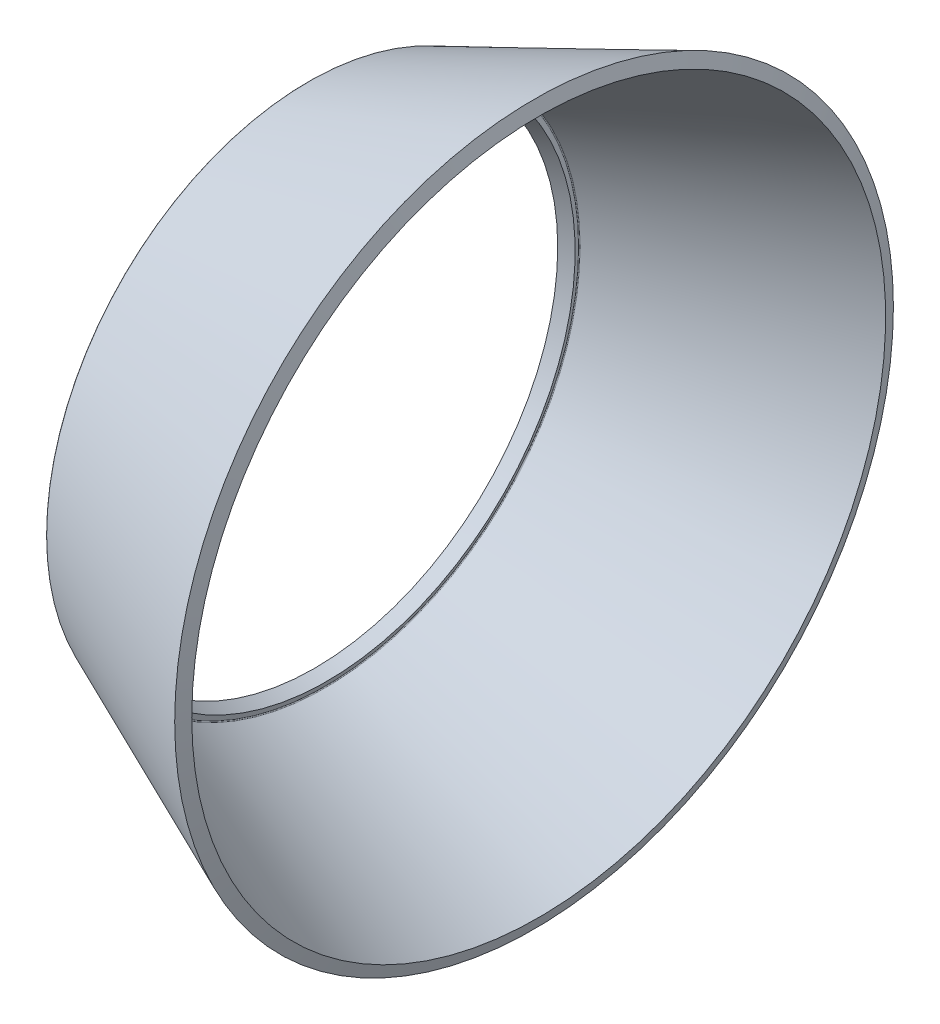
ISO-10303-21;
HEADER;
FILE_DESCRIPTION(('STEP AP214'),'2;1');
FILE_NAME('part.step','',(''),(''),'','','');
FILE_SCHEMA(('AUTOMOTIVE_DESIGN { 1 0 10303 214 1 1 1 1 }'));
ENDSEC;
DATA;
#1=APPLICATION_CONTEXT('core data for automotive mechanical design processes');
#2=APPLICATION_PROTOCOL_DEFINITION('international standard','automotive_design',2000,#1);
#3=PRODUCT_CONTEXT('',#1,'mechanical');
#4=PRODUCT('Part','Part','',(#3));
#5=PRODUCT_RELATED_PRODUCT_CATEGORY('part','',(#4));
#6=PRODUCT_DEFINITION_FORMATION('','',#4);
#7=PRODUCT_DEFINITION_CONTEXT('part definition',#1,'design');
#8=PRODUCT_DEFINITION('design','',#6,#7);
#9=PRODUCT_DEFINITION_SHAPE('','',#8);
#10=(LENGTH_UNIT() NAMED_UNIT(*) SI_UNIT(.MILLI.,.METRE.));
#11=(NAMED_UNIT(*) PLANE_ANGLE_UNIT() SI_UNIT($,.RADIAN.));
#12=(NAMED_UNIT(*) SI_UNIT($,.STERADIAN.) SOLID_ANGLE_UNIT());
#13=UNCERTAINTY_MEASURE_WITH_UNIT(LENGTH_MEASURE(1.E-05),#10,'distance_accuracy_value','');
#14=(GEOMETRIC_REPRESENTATION_CONTEXT(3) GLOBAL_UNCERTAINTY_ASSIGNED_CONTEXT((#13)) GLOBAL_UNIT_ASSIGNED_CONTEXT((#10,
#11,#12)) REPRESENTATION_CONTEXT('',''));
#15=CARTESIAN_POINT('',(0.,0.,0.));
#16=DIRECTION('',(0.,0.,1.));
#17=DIRECTION('',(1.,0.,0.));
#18=AXIS2_PLACEMENT_3D('',#15,#16,#17);
#19=CARTESIAN_POINT('',(16.436741941374,0.,0.));
#20=DIRECTION('',(1.,0.,0.));
#21=DIRECTION('',(0.,1.92329830180224E-10,1.));
#22=AXIS2_PLACEMENT_3D('',#19,#20,#21);
#23=CONICAL_SURFACE('',#22,27.146171241221,0.407543106986939);
#24=CARTESIAN_POINT('',(-0.572586553711304,0.,0.));
#25=DIRECTION('',(1.,0.,0.));
#26=DIRECTION('',(0.,0.,1.));
#27=AXIS2_PLACEMENT_3D('',#24,#25,#26);
#28=CIRCLE('',#27,19.803017838499);
#29=CARTESIAN_POINT('',(-0.572586553711304,0.,19.803017838499));
#30=VERTEX_POINT('',#29);
#31=EDGE_CURVE('E44',#30,#30,#28,.T.);
#32=ORIENTED_EDGE('',*,*,#31,.T.);
#33=EDGE_LOOP('',(#32));
#34=FACE_BOUND('',#33,.T.);
#35=CARTESIAN_POINT('',(16.436741941374,0.,0.));
#36=DIRECTION('',(-1.,0.,0.));
#37=DIRECTION('',(0.,0.,-1.));
#38=AXIS2_PLACEMENT_3D('',#35,#36,#37);
#39=CIRCLE('',#38,27.146171241221);
#40=CARTESIAN_POINT('',(16.436741941374,0.,-27.146171241221));
#41=VERTEX_POINT('',#40);
#42=EDGE_CURVE('E41',#41,#41,#39,.F.);
#43=ORIENTED_EDGE('',*,*,#42,.F.);
#44=EDGE_LOOP('',(#43));
#45=FACE_BOUND('',#44,.T.);
#46=ADVANCED_FACE('F15',(#34,#45),#23,.T.);
#47=CARTESIAN_POINT('',(-0.532951067766462,0.,0.));
#48=DIRECTION('',(1.,0.,0.));
#49=DIRECTION('',(0.,0.,1.));
#50=AXIS2_PLACEMENT_3D('',#47,#48,#49);
#51=TOROIDAL_SURFACE('',#50,19.7112080990699,0.100000000000598);
#52=CARTESIAN_POINT('',(-0.626577270438125,0.,0.));
#53=DIRECTION('',(1.,0.,0.));
#54=DIRECTION('',(0.,0.,1.));
#55=AXIS2_PLACEMENT_3D('',#52,#53,#54);
#56=CIRCLE('',#55,19.676077853221);
#57=CARTESIAN_POINT('',(-0.626577270438125,0.,19.676077853221));
#58=VERTEX_POINT('',#57);
#59=EDGE_CURVE('E38',#58,#58,#56,.T.);
#60=ORIENTED_EDGE('',*,*,#59,.T.);
#61=EDGE_LOOP('',(#60));
#62=FACE_BOUND('',#61,.T.);
#63=ORIENTED_EDGE('',*,*,#31,.F.);
#64=EDGE_LOOP('',(#63));
#65=FACE_BOUND('',#64,.T.);
#66=ADVANCED_FACE('F50',(#62,#65),#51,.T.);
#67=CARTESIAN_POINT('',(-0.626577270438122,0.,0.));
#68=DIRECTION('',(-1.,0.,0.));
#69=DIRECTION('',(0.,0.,-1.));
#70=AXIS2_PLACEMENT_3D('',#67,#68,#69);
#71=CONICAL_SURFACE('',#70,19.676077853221,1.21183445953715);
#72=ORIENTED_EDGE('',*,*,#59,.F.);
#73=EDGE_LOOP('',(#72));
#74=FACE_BOUND('',#73,.T.);
#75=CARTESIAN_POINT('',(-0.132464857124163,0.,0.));
#76=DIRECTION('',(1.,0.,0.));
#77=DIRECTION('',(0.,0.,1.));
#78=AXIS2_PLACEMENT_3D('',#75,#76,#77);
#79=CIRCLE('',#78,18.359210639981);
#80=CARTESIAN_POINT('',(-0.132464857124163,0.,18.359210639981));
#81=VERTEX_POINT('',#80);
#82=EDGE_CURVE('E35',#81,#81,#79,.T.);
#83=ORIENTED_EDGE('',*,*,#82,.T.);
#84=EDGE_LOOP('',(#83));
#85=FACE_BOUND('',#84,.T.);
#86=ADVANCED_FACE('F52',(#74,#85),#71,.F.);
#87=CARTESIAN_POINT('',(0.786717021356409,0.,0.));
#88=DIRECTION('',(1.,0.,0.));
#89=DIRECTION('',(0.,0.,1.));
#90=AXIS2_PLACEMENT_3D('',#87,#88,#89);
#91=CONICAL_SURFACE('',#90,18.756033685678,0.407543106986696);
#92=CARTESIAN_POINT('',(0.786717021356409,0.,0.));
#93=DIRECTION('',(1.,0.,0.));
#94=DIRECTION('',(0.,0.,1.));
#95=AXIS2_PLACEMENT_3D('',#92,#93,#94);
#96=CIRCLE('',#95,18.756033685678);
#97=CARTESIAN_POINT('',(0.786717021356409,0.,18.756033685678));
#98=VERTEX_POINT('',#97);
#99=EDGE_CURVE('E30',#98,#98,#96,.T.);
#100=ORIENTED_EDGE('',*,*,#99,.T.);
#101=EDGE_LOOP('',(#100));
#102=FACE_BOUND('',#101,.T.);
#103=ORIENTED_EDGE('',*,*,#82,.F.);
#104=EDGE_LOOP('',(#103));
#105=FACE_BOUND('',#104,.T.);
#106=ADVANCED_FACE('F60',(#102,#105),#91,.F.);
#107=CARTESIAN_POINT('',(0.633167459560533,0.,0.));
#108=DIRECTION('',(-1.,0.,0.));
#109=DIRECTION('',(0.,0.,-1.));
#110=AXIS2_PLACEMENT_3D('',#107,#108,#109);
#111=CONICAL_SURFACE('',#110,19.165261177415,1.21183445953753);
#112=ORIENTED_EDGE('',*,*,#99,.F.);
#113=EDGE_LOOP('',(#112));
#114=FACE_BOUND('',#113,.T.);
#115=CARTESIAN_POINT('',(0.633167459560536,0.,0.));
#116=DIRECTION('',(1.,0.,0.));
#117=DIRECTION('',(0.,0.,1.));
#118=AXIS2_PLACEMENT_3D('',#115,#116,#117);
#119=CIRCLE('',#118,19.165261177415);
#120=CARTESIAN_POINT('',(0.633167459560536,0.,19.165261177415));
#121=VERTEX_POINT('',#120);
#122=EDGE_CURVE('E26',#121,#121,#119,.T.);
#123=ORIENTED_EDGE('',*,*,#122,.T.);
#124=EDGE_LOOP('',(#123));
#125=FACE_BOUND('',#124,.T.);
#126=ADVANCED_FACE('F67',(#114,#125),#111,.T.);
#127=CARTESIAN_POINT('',(0.695584928006938,0.,0.));
#128=DIRECTION('',(1.,0.,0.));
#129=DIRECTION('',(0.,0.,1.));
#130=AXIS2_PLACEMENT_3D('',#127,#128,#129);
#131=TOROIDAL_SURFACE('',#130,19.1886813413142,0.0666666666657383);
#132=CARTESIAN_POINT('',(0.669161270711734,0.,0.));
#133=DIRECTION('',(1.,0.,0.));
#134=DIRECTION('',(0.,0.,1.));
#135=AXIS2_PLACEMENT_3D('',#132,#133,#134);
#136=CIRCLE('',#135,19.249887834266);
#137=CARTESIAN_POINT('',(0.669161270711734,0.,19.249887834266));
#138=VERTEX_POINT('',#137);
#139=EDGE_CURVE('E22',#138,#138,#136,.T.);
#140=ORIENTED_EDGE('',*,*,#139,.T.);
#141=EDGE_LOOP('',(#140));
#142=FACE_BOUND('',#141,.T.);
#143=ORIENTED_EDGE('',*,*,#122,.F.);
#144=EDGE_LOOP('',(#143));
#145=FACE_BOUND('',#144,.T.);
#146=ADVANCED_FACE('F71',(#142,#145),#131,.F.);
#147=CARTESIAN_POINT('',(16.788459368868,0.,0.));
#148=DIRECTION('',(1.,0.,0.));
#149=DIRECTION('',(0.,0.,1.));
#150=AXIS2_PLACEMENT_3D('',#147,#148,#149);
#151=CONICAL_SURFACE('',#150,26.208803273707,0.40754310698696);
#152=CARTESIAN_POINT('',(16.788459368868,0.,0.));
#153=DIRECTION('',(1.,0.,0.));
#154=DIRECTION('',(0.,0.,1.));
#155=AXIS2_PLACEMENT_3D('',#152,#153,#154);
#156=CIRCLE('',#155,26.208803273707);
#157=CARTESIAN_POINT('',(16.788459368868,0.,26.208803273707));
#158=VERTEX_POINT('',#157);
#159=EDGE_CURVE('E10',#158,#158,#156,.T.);
#160=ORIENTED_EDGE('',*,*,#159,.T.);
#161=EDGE_LOOP('',(#160));
#162=FACE_BOUND('',#161,.T.);
#163=ORIENTED_EDGE('',*,*,#139,.F.);
#164=EDGE_LOOP('',(#163));
#165=FACE_BOUND('',#164,.T.);
#166=ADVANCED_FACE('F74',(#162,#165),#151,.F.);
#167=CARTESIAN_POINT('',(16.436741941374,0.,0.));
#168=DIRECTION('',(-1.,0.,0.));
#169=DIRECTION('',(0.,0.,-1.));
#170=AXIS2_PLACEMENT_3D('',#167,#168,#169);
#171=CONICAL_SURFACE('',#170,27.146171241221,1.21183445953685);
#172=ORIENTED_EDGE('',*,*,#42,.T.);
#173=EDGE_LOOP('',(#172));
#174=FACE_BOUND('',#173,.T.);
#175=ORIENTED_EDGE('',*,*,#159,.F.);
#176=EDGE_LOOP('',(#175));
#177=FACE_BOUND('',#176,.T.);
#178=ADVANCED_FACE('F17',(#174,#177),#171,.T.);
#179=CLOSED_SHELL('',(#46,#66,#86,#106,#126,#146,#166,#178));
#180=MANIFOLD_SOLID_BREP('B1',#179);
#181=ADVANCED_BREP_SHAPE_REPRESENTATION('',(#18,#180),#14);
#182=SHAPE_DEFINITION_REPRESENTATION(#9,#181);
ENDSEC;
END-ISO-10303-21;
